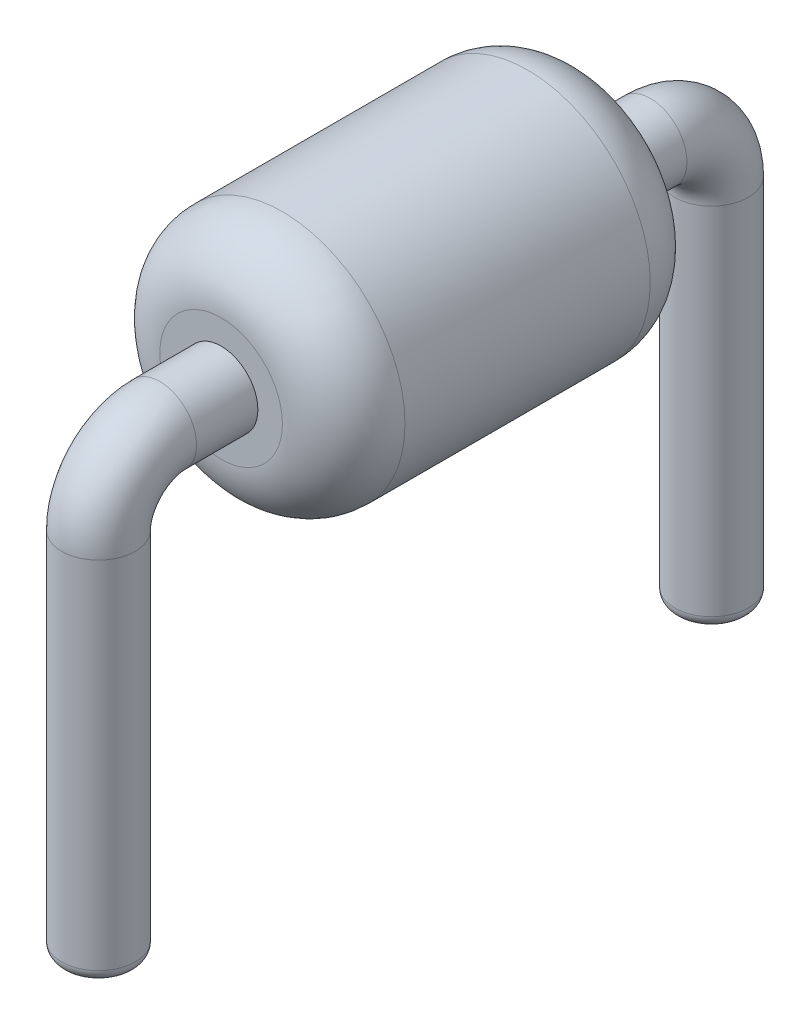
ISO-10303-21;
HEADER;
FILE_DESCRIPTION(('STEP AP214'),'2;1');
FILE_NAME('part.step','',(''),(''),'','','');
FILE_SCHEMA(('AUTOMOTIVE_DESIGN { 1 0 10303 214 1 1 1 1 }'));
ENDSEC;
DATA;
#1=APPLICATION_CONTEXT('core data for automotive mechanical design processes');
#2=APPLICATION_PROTOCOL_DEFINITION('international standard','automotive_design',2000,#1);
#3=PRODUCT_CONTEXT('',#1,'mechanical');
#4=PRODUCT('Part','Part','',(#3));
#5=PRODUCT_RELATED_PRODUCT_CATEGORY('part','',(#4));
#6=PRODUCT_DEFINITION_FORMATION('','',#4);
#7=PRODUCT_DEFINITION_CONTEXT('part definition',#1,'design');
#8=PRODUCT_DEFINITION('design','',#6,#7);
#9=PRODUCT_DEFINITION_SHAPE('','',#8);
#10=(LENGTH_UNIT() NAMED_UNIT(*) SI_UNIT(.MILLI.,.METRE.));
#11=(NAMED_UNIT(*) PLANE_ANGLE_UNIT() SI_UNIT($,.RADIAN.));
#12=(NAMED_UNIT(*) SI_UNIT($,.STERADIAN.) SOLID_ANGLE_UNIT());
#13=UNCERTAINTY_MEASURE_WITH_UNIT(LENGTH_MEASURE(1.E-05),#10,'distance_accuracy_value','');
#14=(GEOMETRIC_REPRESENTATION_CONTEXT(3) GLOBAL_UNCERTAINTY_ASSIGNED_CONTEXT((#13)) GLOBAL_UNIT_ASSIGNED_CONTEXT((#10,
#11,#12)) REPRESENTATION_CONTEXT('',''));
#15=CARTESIAN_POINT('',(0.,0.,0.));
#16=DIRECTION('',(0.,0.,1.));
#17=DIRECTION('',(1.,0.,0.));
#18=AXIS2_PLACEMENT_3D('',#15,#16,#17);
#19=CARTESIAN_POINT('',(0.,3.5,-0.5));
#20=DIRECTION('',(0.,0.,-1.));
#21=DIRECTION('',(-1.,0.,0.));
#22=AXIS2_PLACEMENT_3D('',#19,#20,#21);
#23=CYLINDRICAL_SURFACE('',#22,0.3);
#24=CARTESIAN_POINT('',(0.,3.5,-4.5));
#25=DIRECTION('',(0.,0.,-1.));
#26=DIRECTION('',(0.,1.,0.));
#27=AXIS2_PLACEMENT_3D('',#24,#25,#26);
#28=CIRCLE('',#27,0.3);
#29=CARTESIAN_POINT('',(0.,3.8,-4.5));
#30=VERTEX_POINT('',#29);
#31=EDGE_CURVE('E70',#30,#30,#28,.T.);
#32=ORIENTED_EDGE('',*,*,#31,.F.);
#33=EDGE_LOOP('',(#32));
#34=FACE_BOUND('',#33,.T.);
#35=CARTESIAN_POINT('',(0.,3.5,-4.));
#36=DIRECTION('',(0.,0.,1.));
#37=DIRECTION('',(1.,0.,0.));
#38=AXIS2_PLACEMENT_3D('',#35,#36,#37);
#39=CIRCLE('',#38,0.3);
#40=CARTESIAN_POINT('',(0.3,3.5,-4.));
#41=VERTEX_POINT('',#40);
#42=EDGE_CURVE('E79',#41,#41,#39,.T.);
#43=ORIENTED_EDGE('',*,*,#42,.F.);
#44=EDGE_LOOP('',(#43));
#45=FACE_BOUND('',#44,.T.);
#46=ADVANCED_FACE('F32',(#34,#45),#23,.T.);
#47=CARTESIAN_POINT('',(0.,3.,-5.));
#48=DIRECTION('',(0.,-1.,0.));
#49=DIRECTION('',(0.,0.,-1.));
#50=AXIS2_PLACEMENT_3D('',#47,#48,#49);
#51=CYLINDRICAL_SURFACE('',#50,0.3);
#52=CARTESIAN_POINT('',(0.,0.099999999999999,-5.));
#53=DIRECTION('',(0.,-1.,0.));
#54=DIRECTION('',(0.,0.,-1.));
#55=AXIS2_PLACEMENT_3D('',#52,#53,#54);
#56=CIRCLE('',#55,0.3);
#57=CARTESIAN_POINT('',(0.,0.099999999999999,-5.3));
#58=VERTEX_POINT('',#57);
#59=EDGE_CURVE('E43',#58,#58,#56,.F.);
#60=ORIENTED_EDGE('',*,*,#59,.T.);
#61=EDGE_LOOP('',(#60));
#62=FACE_BOUND('',#61,.T.);
#63=CARTESIAN_POINT('',(0.,3.,-5.));
#64=DIRECTION('',(0.,-1.,0.));
#65=DIRECTION('',(0.,0.,-1.));
#66=AXIS2_PLACEMENT_3D('',#63,#64,#65);
#67=CIRCLE('',#66,0.3);
#68=CARTESIAN_POINT('',(0.,3.,-5.3));
#69=VERTEX_POINT('',#68);
#70=EDGE_CURVE('E67',#69,#69,#67,.T.);
#71=ORIENTED_EDGE('',*,*,#70,.T.);
#72=EDGE_LOOP('',(#71));
#73=FACE_BOUND('',#72,.T.);
#74=ADVANCED_FACE('F86',(#62,#73),#51,.T.);
#75=CARTESIAN_POINT('',(0.,3.,-4.5));
#76=DIRECTION('',(-1.,0.,0.));
#77=DIRECTION('',(0.,0.,1.));
#78=AXIS2_PLACEMENT_3D('',#75,#76,#77);
#79=TOROIDAL_SURFACE('',#78,0.5,0.3);
#80=CARTESIAN_POINT('',(0.,3.,-4.5));
#81=DIRECTION('',(-1.,0.,0.));
#82=DIRECTION('',(0.,0.,1.));
#83=AXIS2_PLACEMENT_3D('',#80,#81,#82);
#84=CIRCLE('',#83,0.799999999999999);
#85=EDGE_CURVE('',#30,#69,#84,.T.);
#86=ORIENTED_EDGE('',*,*,#31,.T.);
#87=ORIENTED_EDGE('',*,*,#70,.F.);
#88=ORIENTED_EDGE('',*,*,#85,.T.);
#89=ORIENTED_EDGE('',*,*,#85,.F.);
#90=EDGE_LOOP('',(#86,#88,#87,#89));
#91=FACE_BOUND('',#90,.T.);
#92=ADVANCED_FACE('F93',(#91),#79,.T.);
#93=CARTESIAN_POINT('',(0.,0.,-5.));
#94=DIRECTION('',(0.,-1.,0.));
#95=DIRECTION('',(0.,0.,-1.));
#96=AXIS2_PLACEMENT_3D('',#93,#94,#95);
#97=PLANE('',#96);
#98=CARTESIAN_POINT('',(0.,0.,-5.));
#99=DIRECTION('',(0.,-1.,0.));
#100=DIRECTION('',(0.,0.,-1.));
#101=AXIS2_PLACEMENT_3D('',#98,#99,#100);
#102=CIRCLE('',#101,0.2);
#103=CARTESIAN_POINT('',(0.,0.,-5.2));
#104=VERTEX_POINT('',#103);
#105=EDGE_CURVE('E47',#104,#104,#102,.T.);
#106=ORIENTED_EDGE('',*,*,#105,.T.);
#107=EDGE_LOOP('',(#106));
#108=FACE_BOUND('',#107,.T.);
#109=ADVANCED_FACE('F133',(#108),#97,.T.);
#110=CARTESIAN_POINT('',(0.,3.5,-4.));
#111=DIRECTION('',(0.,0.,1.));
#112=DIRECTION('',(1.,0.,0.));
#113=AXIS2_PLACEMENT_3D('',#110,#111,#112);
#114=CYLINDRICAL_SURFACE('',#113,1.);
#115=CARTESIAN_POINT('',(0.,3.5,-3.5));
#116=DIRECTION('',(0.,0.,1.));
#117=DIRECTION('',(1.,0.,0.));
#118=AXIS2_PLACEMENT_3D('',#115,#116,#117);
#119=CIRCLE('',#118,1.);
#120=CARTESIAN_POINT('',(1.,3.5,-3.5));
#121=VERTEX_POINT('',#120);
#122=EDGE_CURVE('E58',#121,#121,#119,.T.);
#123=ORIENTED_EDGE('',*,*,#122,.T.);
#124=EDGE_LOOP('',(#123));
#125=FACE_BOUND('',#124,.T.);
#126=CARTESIAN_POINT('',(0.,3.5,-1.5));
#127=DIRECTION('',(0.,0.,1.));
#128=DIRECTION('',(1.,0.,0.));
#129=AXIS2_PLACEMENT_3D('',#126,#127,#128);
#130=CIRCLE('',#129,1.);
#131=CARTESIAN_POINT('',(1.,3.5,-1.5));
#132=VERTEX_POINT('',#131);
#133=EDGE_CURVE('E61',#132,#132,#130,.F.);
#134=ORIENTED_EDGE('',*,*,#133,.T.);
#135=EDGE_LOOP('',(#134));
#136=FACE_BOUND('',#135,.T.);
#137=ADVANCED_FACE('F127',(#125,#136),#114,.T.);
#138=CARTESIAN_POINT('',(0.,3.5,-4.));
#139=DIRECTION('',(0.,0.,1.));
#140=DIRECTION('',(1.,0.,0.));
#141=AXIS2_PLACEMENT_3D('',#138,#139,#140);
#142=PLANE('',#141);
#143=CARTESIAN_POINT('',(0.,3.5,-4.));
#144=DIRECTION('',(0.,0.,1.));
#145=DIRECTION('',(1.,0.,0.));
#146=AXIS2_PLACEMENT_3D('',#143,#144,#145);
#147=CIRCLE('',#146,0.5);
#148=CARTESIAN_POINT('',(0.5,3.5,-4.));
#149=VERTEX_POINT('',#148);
#150=EDGE_CURVE('E55',#149,#149,#147,.F.);
#151=ORIENTED_EDGE('',*,*,#150,.T.);
#152=EDGE_LOOP('',(#151));
#153=FACE_BOUND('',#152,.T.);
#154=ORIENTED_EDGE('',*,*,#42,.T.);
#155=EDGE_LOOP('',(#154));
#156=FACE_BOUND('',#155,.T.);
#157=ADVANCED_FACE('F83',(#153,#156),#142,.F.);
#158=CARTESIAN_POINT('',(0.,3.5,-1.));
#159=DIRECTION('',(0.,0.,1.));
#160=DIRECTION('',(1.,0.,0.));
#161=AXIS2_PLACEMENT_3D('',#158,#159,#160);
#162=PLANE('',#161);
#163=CARTESIAN_POINT('',(0.,3.5,-1.));
#164=DIRECTION('',(0.,0.,1.));
#165=DIRECTION('',(1.,0.,0.));
#166=AXIS2_PLACEMENT_3D('',#163,#164,#165);
#167=CIRCLE('',#166,0.5);
#168=CARTESIAN_POINT('',(0.5,3.5,-1.));
#169=VERTEX_POINT('',#168);
#170=EDGE_CURVE('E52',#169,#169,#167,.T.);
#171=ORIENTED_EDGE('',*,*,#170,.T.);
#172=EDGE_LOOP('',(#171));
#173=FACE_BOUND('',#172,.T.);
#174=CARTESIAN_POINT('',(0.,3.5,-1.));
#175=DIRECTION('',(0.,0.,1.));
#176=DIRECTION('',(1.,0.,0.));
#177=AXIS2_PLACEMENT_3D('',#174,#175,#176);
#178=CIRCLE('',#177,0.3);
#179=CARTESIAN_POINT('',(0.3,3.5,-1.));
#180=VERTEX_POINT('',#179);
#181=EDGE_CURVE('E64',#180,#180,#178,.F.);
#182=ORIENTED_EDGE('',*,*,#181,.T.);
#183=EDGE_LOOP('',(#182));
#184=FACE_BOUND('',#183,.T.);
#185=ADVANCED_FACE('F117',(#173,#184),#162,.T.);
#186=CARTESIAN_POINT('',(0.,0.,0.));
#187=DIRECTION('',(0.,1.,0.));
#188=DIRECTION('',(0.,0.,1.));
#189=AXIS2_PLACEMENT_3D('',#186,#187,#188);
#190=PLANE('',#189);
#191=CARTESIAN_POINT('',(0.,0.,0.));
#192=DIRECTION('',(0.,1.,0.));
#193=DIRECTION('',(0.,0.,1.));
#194=AXIS2_PLACEMENT_3D('',#191,#192,#193);
#195=CIRCLE('',#194,0.2);
#196=CARTESIAN_POINT('',(0.,0.,0.2));
#197=VERTEX_POINT('',#196);
#198=EDGE_CURVE('E10',#197,#197,#195,.F.);
#199=ORIENTED_EDGE('',*,*,#198,.T.);
#200=EDGE_LOOP('',(#199));
#201=FACE_BOUND('',#200,.T.);
#202=ADVANCED_FACE('F119',(#201),#190,.F.);
#203=CARTESIAN_POINT('',(0.,3.,0.));
#204=DIRECTION('',(0.,-1.,0.));
#205=DIRECTION('',(0.,0.,-1.));
#206=AXIS2_PLACEMENT_3D('',#203,#204,#205);
#207=CYLINDRICAL_SURFACE('',#206,0.3);
#208=CARTESIAN_POINT('',(0.,0.0999999999999998,0.));
#209=DIRECTION('',(0.,1.,0.));
#210=DIRECTION('',(0.,0.,1.));
#211=AXIS2_PLACEMENT_3D('',#208,#209,#210);
#212=CIRCLE('',#211,0.3);
#213=CARTESIAN_POINT('',(0.,0.0999999999999998,0.3));
#214=VERTEX_POINT('',#213);
#215=EDGE_CURVE('E39',#214,#214,#212,.T.);
#216=ORIENTED_EDGE('',*,*,#215,.T.);
#217=EDGE_LOOP('',(#216));
#218=FACE_BOUND('',#217,.T.);
#219=CARTESIAN_POINT('',(0.,3.,0.));
#220=DIRECTION('',(0.,1.,0.));
#221=DIRECTION('',(0.,0.,1.));
#222=AXIS2_PLACEMENT_3D('',#219,#220,#221);
#223=CIRCLE('',#222,0.3);
#224=CARTESIAN_POINT('',(0.,3.,0.3));
#225=VERTEX_POINT('',#224);
#226=EDGE_CURVE('E76',#225,#225,#223,.T.);
#227=ORIENTED_EDGE('',*,*,#226,.F.);
#228=EDGE_LOOP('',(#227));
#229=FACE_BOUND('',#228,.T.);
#230=ADVANCED_FACE('F110',(#218,#229),#207,.T.);
#231=CARTESIAN_POINT('',(0.,3.,-0.5));
#232=DIRECTION('',(-1.,0.,0.));
#233=DIRECTION('',(0.,0.,1.));
#234=AXIS2_PLACEMENT_3D('',#231,#232,#233);
#235=TOROIDAL_SURFACE('',#234,0.5,0.3);
#236=CARTESIAN_POINT('',(0.,3.5,-0.5));
#237=DIRECTION('',(0.,0.,-1.));
#238=DIRECTION('',(0.,1.,0.));
#239=AXIS2_PLACEMENT_3D('',#236,#237,#238);
#240=CIRCLE('',#239,0.3);
#241=CARTESIAN_POINT('',(0.,3.8,-0.5));
#242=VERTEX_POINT('',#241);
#243=EDGE_CURVE('E73',#242,#242,#240,.T.);
#244=CARTESIAN_POINT('',(0.,3.,-0.5));
#245=DIRECTION('',(-1.,0.,0.));
#246=DIRECTION('',(0.,0.,1.));
#247=AXIS2_PLACEMENT_3D('',#244,#245,#246);
#248=CIRCLE('',#247,0.8);
#249=EDGE_CURVE('',#225,#242,#248,.T.);
#250=ORIENTED_EDGE('',*,*,#226,.T.);
#251=ORIENTED_EDGE('',*,*,#243,.F.);
#252=ORIENTED_EDGE('',*,*,#249,.T.);
#253=ORIENTED_EDGE('',*,*,#249,.F.);
#254=EDGE_LOOP('',(#250,#252,#251,#253));
#255=FACE_BOUND('',#254,.T.);
#256=ADVANCED_FACE('F101',(#255),#235,.T.);
#257=ORIENTED_EDGE('',*,*,#181,.F.);
#258=EDGE_LOOP('',(#257));
#259=FACE_BOUND('',#258,.T.);
#260=ORIENTED_EDGE('',*,*,#243,.T.);
#261=EDGE_LOOP('',(#260));
#262=FACE_BOUND('',#261,.T.);
#263=ADVANCED_FACE('F89',(#259,#262),#23,.T.);
#264=CARTESIAN_POINT('',(0.,3.5,-3.5));
#265=DIRECTION('',(0.,0.,1.));
#266=DIRECTION('',(1.,0.,0.));
#267=AXIS2_PLACEMENT_3D('',#264,#265,#266);
#268=DEGENERATE_TOROIDAL_SURFACE('',#267,0.5,0.5,.T.);
#269=ORIENTED_EDGE('',*,*,#150,.F.);
#270=EDGE_LOOP('',(#269));
#271=FACE_BOUND('',#270,.T.);
#272=ORIENTED_EDGE('',*,*,#122,.F.);
#273=EDGE_LOOP('',(#272));
#274=FACE_BOUND('',#273,.T.);
#275=ADVANCED_FACE('F100',(#271,#274),#268,.T.);
#276=CARTESIAN_POINT('',(0.,3.5,-1.5));
#277=DIRECTION('',(0.,0.,1.));
#278=DIRECTION('',(1.,0.,0.));
#279=AXIS2_PLACEMENT_3D('',#276,#277,#278);
#280=DEGENERATE_TOROIDAL_SURFACE('',#279,0.5,0.5,.T.);
#281=ORIENTED_EDGE('',*,*,#133,.F.);
#282=EDGE_LOOP('',(#281));
#283=FACE_BOUND('',#282,.T.);
#284=ORIENTED_EDGE('',*,*,#170,.F.);
#285=EDGE_LOOP('',(#284));
#286=FACE_BOUND('',#285,.T.);
#287=ADVANCED_FACE('F107',(#283,#286),#280,.T.);
#288=CARTESIAN_POINT('',(0.,0.099999999999999,-5.));
#289=DIRECTION('',(0.,-1.,0.));
#290=DIRECTION('',(0.,0.,-1.));
#291=AXIS2_PLACEMENT_3D('',#288,#289,#290);
#292=TOROIDAL_SURFACE('',#291,0.2,0.1);
#293=ORIENTED_EDGE('',*,*,#59,.F.);
#294=EDGE_LOOP('',(#293));
#295=FACE_BOUND('',#294,.T.);
#296=ORIENTED_EDGE('',*,*,#105,.F.);
#297=EDGE_LOOP('',(#296));
#298=FACE_BOUND('',#297,.T.);
#299=ADVANCED_FACE('F194',(#295,#298),#292,.T.);
#300=CARTESIAN_POINT('',(0.,0.0999999999999998,0.));
#301=DIRECTION('',(0.,1.,0.));
#302=DIRECTION('',(0.,0.,1.));
#303=AXIS2_PLACEMENT_3D('',#300,#301,#302);
#304=TOROIDAL_SURFACE('',#303,0.2,0.1);
#305=ORIENTED_EDGE('',*,*,#198,.F.);
#306=EDGE_LOOP('',(#305));
#307=FACE_BOUND('',#306,.T.);
#308=ORIENTED_EDGE('',*,*,#215,.F.);
#309=EDGE_LOOP('',(#308));
#310=FACE_BOUND('',#309,.T.);
#311=ADVANCED_FACE('F34',(#307,#310),#304,.T.);
#312=CLOSED_SHELL('',(#46,#74,#92,#109,#137,#157,#185,#202,#230,#256,#263,#275,#287,#299,#311));
#313=MANIFOLD_SOLID_BREP('B2',#312);
#314=ADVANCED_BREP_SHAPE_REPRESENTATION('',(#18,#313),#14);
#315=SHAPE_DEFINITION_REPRESENTATION(#9,#314);
ENDSEC;
END-ISO-10303-21;
